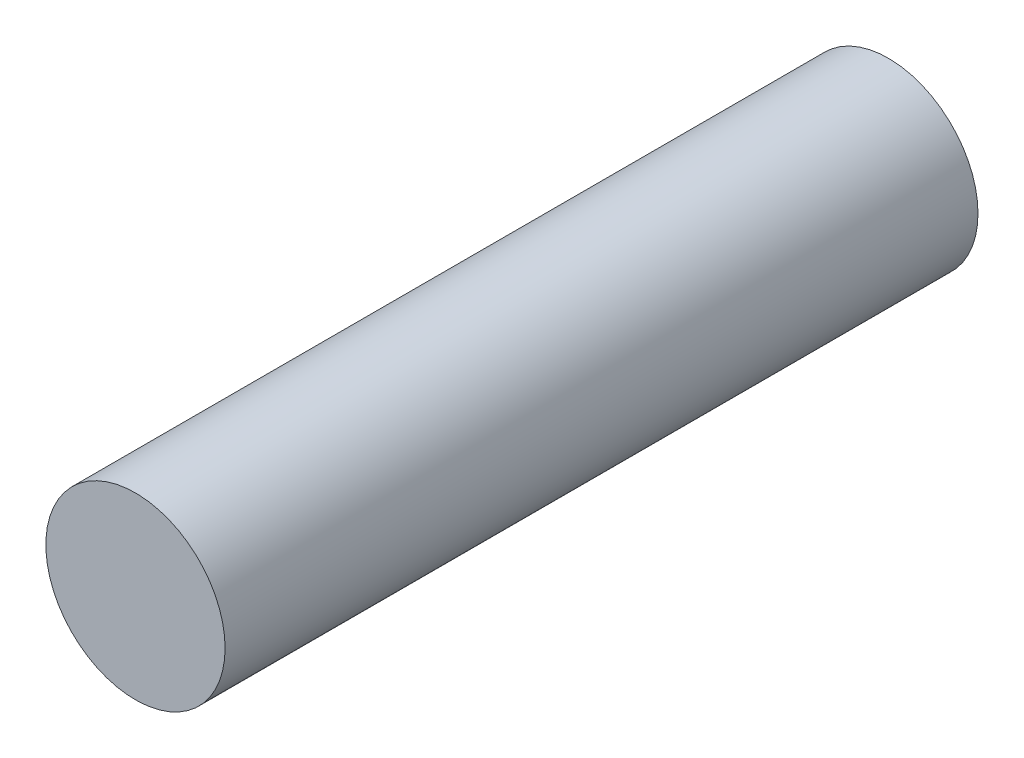
ISO-10303-21;
HEADER;
FILE_DESCRIPTION(('STEP AP214'),'2;1');
FILE_NAME('part.step','',(''),(''),'','','');
FILE_SCHEMA(('AUTOMOTIVE_DESIGN { 1 0 10303 214 1 1 1 1 }'));
ENDSEC;
DATA;
#1=APPLICATION_CONTEXT('core data for automotive mechanical design processes');
#2=APPLICATION_PROTOCOL_DEFINITION('international standard','automotive_design',2000,#1);
#3=PRODUCT_CONTEXT('',#1,'mechanical');
#4=PRODUCT('Part','Part','',(#3));
#5=PRODUCT_RELATED_PRODUCT_CATEGORY('part','',(#4));
#6=PRODUCT_DEFINITION_FORMATION('','',#4);
#7=PRODUCT_DEFINITION_CONTEXT('part definition',#1,'design');
#8=PRODUCT_DEFINITION('design','',#6,#7);
#9=PRODUCT_DEFINITION_SHAPE('','',#8);
#10=(LENGTH_UNIT() NAMED_UNIT(*) SI_UNIT(.MILLI.,.METRE.));
#11=(NAMED_UNIT(*) PLANE_ANGLE_UNIT() SI_UNIT($,.RADIAN.));
#12=(NAMED_UNIT(*) SI_UNIT($,.STERADIAN.) SOLID_ANGLE_UNIT());
#13=UNCERTAINTY_MEASURE_WITH_UNIT(LENGTH_MEASURE(1.E-05),#10,'distance_accuracy_value','');
#14=(GEOMETRIC_REPRESENTATION_CONTEXT(3) GLOBAL_UNCERTAINTY_ASSIGNED_CONTEXT((#13)) GLOBAL_UNIT_ASSIGNED_CONTEXT((#10,
#11,#12)) REPRESENTATION_CONTEXT('',''));
#15=CARTESIAN_POINT('',(0.,0.,0.));
#16=DIRECTION('',(0.,0.,1.));
#17=DIRECTION('',(1.,0.,0.));
#18=AXIS2_PLACEMENT_3D('',#15,#16,#17);
#19=CARTESIAN_POINT('',(0.,0.,2.1));
#20=DIRECTION('',(0.,0.,-1.));
#21=DIRECTION('',(-1.,0.,0.));
#22=AXIS2_PLACEMENT_3D('',#19,#20,#21);
#23=CYLINDRICAL_SURFACE('',#22,0.5);
#24=CARTESIAN_POINT('',(0.,0.,2.1));
#25=DIRECTION('',(0.,0.,1.));
#26=DIRECTION('',(1.,0.,0.));
#27=AXIS2_PLACEMENT_3D('',#24,#25,#26);
#28=CIRCLE('',#27,0.5);
#29=CARTESIAN_POINT('',(0.5,0.,2.1));
#30=VERTEX_POINT('',#29);
#31=EDGE_CURVE('E10',#30,#30,#28,.T.);
#32=ORIENTED_EDGE('',*,*,#31,.F.);
#33=EDGE_LOOP('',(#32));
#34=FACE_BOUND('',#33,.T.);
#35=CARTESIAN_POINT('',(0.,0.,-2.1));
#36=DIRECTION('',(0.,0.,1.));
#37=DIRECTION('',(1.,0.,0.));
#38=AXIS2_PLACEMENT_3D('',#35,#36,#37);
#39=CIRCLE('',#38,0.5);
#40=CARTESIAN_POINT('',(0.499999999999983,0.,-2.1));
#41=VERTEX_POINT('',#40);
#42=EDGE_CURVE('E36',#41,#41,#39,.T.);
#43=ORIENTED_EDGE('',*,*,#42,.T.);
#44=EDGE_LOOP('',(#43));
#45=FACE_BOUND('',#44,.T.);
#46=ADVANCED_FACE('F30',(#34,#45),#23,.T.);
#47=CARTESIAN_POINT('',(0.,0.,2.1));
#48=DIRECTION('',(0.,0.,1.));
#49=DIRECTION('',(1.,0.,0.));
#50=AXIS2_PLACEMENT_3D('',#47,#48,#49);
#51=PLANE('',#50);
#52=ORIENTED_EDGE('',*,*,#31,.T.);
#53=EDGE_LOOP('',(#52));
#54=FACE_BOUND('',#53,.T.);
#55=ADVANCED_FACE('F45',(#54),#51,.T.);
#56=CARTESIAN_POINT('',(0.,0.,-2.1));
#57=DIRECTION('',(0.,0.,1.));
#58=DIRECTION('',(1.,0.,0.));
#59=AXIS2_PLACEMENT_3D('',#56,#57,#58);
#60=PLANE('',#59);
#61=ORIENTED_EDGE('',*,*,#42,.F.);
#62=EDGE_LOOP('',(#61));
#63=FACE_BOUND('',#62,.T.);
#64=ADVANCED_FACE('F43',(#63),#60,.F.);
#65=CLOSED_SHELL('',(#46,#55,#64));
#66=MANIFOLD_SOLID_BREP('B2',#65);
#67=ADVANCED_BREP_SHAPE_REPRESENTATION('',(#18,#66),#14);
#68=SHAPE_DEFINITION_REPRESENTATION(#9,#67);
ENDSEC;
END-ISO-10303-21;
